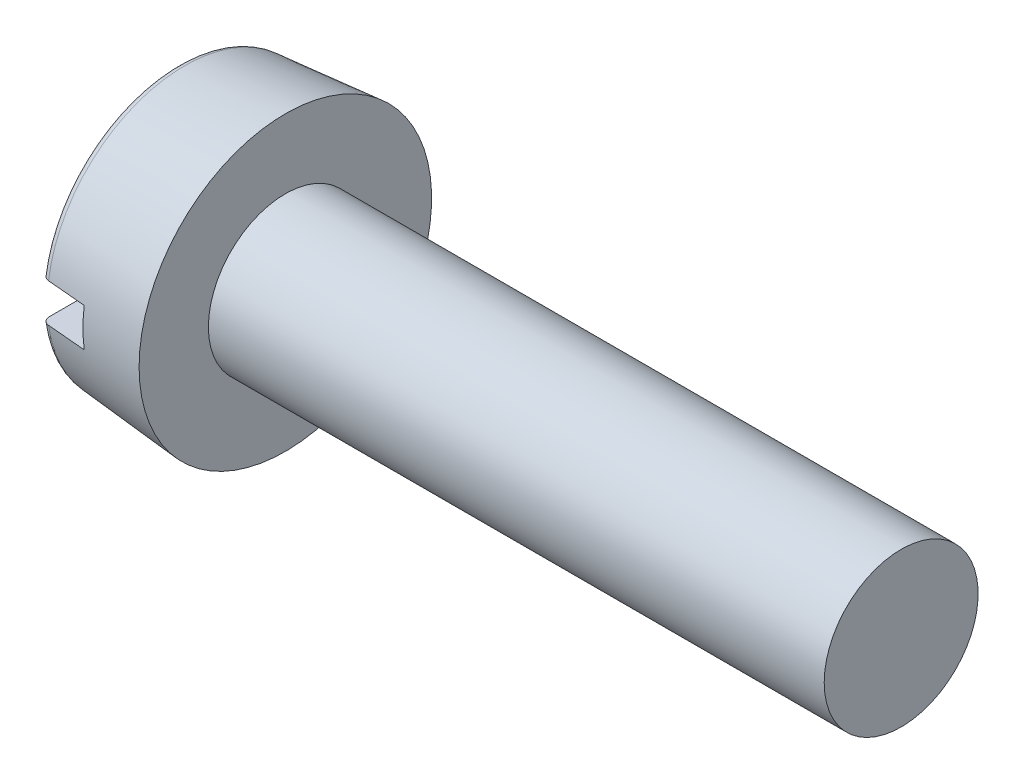
ISO-10303-21;
HEADER;
FILE_DESCRIPTION(('STEP AP214'),'2;1');
FILE_NAME('part.step','',(''),(''),'','','');
FILE_SCHEMA(('AUTOMOTIVE_DESIGN { 1 0 10303 214 1 1 1 1 }'));
ENDSEC;
DATA;
#1=APPLICATION_CONTEXT('core data for automotive mechanical design processes');
#2=APPLICATION_PROTOCOL_DEFINITION('international standard','automotive_design',2000,#1);
#3=PRODUCT_CONTEXT('',#1,'mechanical');
#4=PRODUCT('Part','Part','',(#3));
#5=PRODUCT_RELATED_PRODUCT_CATEGORY('part','',(#4));
#6=PRODUCT_DEFINITION_FORMATION('','',#4);
#7=PRODUCT_DEFINITION_CONTEXT('part definition',#1,'design');
#8=PRODUCT_DEFINITION('design','',#6,#7);
#9=PRODUCT_DEFINITION_SHAPE('','',#8);
#10=(LENGTH_UNIT() NAMED_UNIT(*) SI_UNIT(.MILLI.,.METRE.));
#11=(NAMED_UNIT(*) PLANE_ANGLE_UNIT() SI_UNIT($,.RADIAN.));
#12=(NAMED_UNIT(*) SI_UNIT($,.STERADIAN.) SOLID_ANGLE_UNIT());
#13=UNCERTAINTY_MEASURE_WITH_UNIT(LENGTH_MEASURE(1.E-05),#10,'distance_accuracy_value','');
#14=(GEOMETRIC_REPRESENTATION_CONTEXT(3) GLOBAL_UNCERTAINTY_ASSIGNED_CONTEXT((#13)) GLOBAL_UNIT_ASSIGNED_CONTEXT((#10,
#11,#12)) REPRESENTATION_CONTEXT('',''));
#15=CARTESIAN_POINT('',(0.,0.,0.));
#16=DIRECTION('',(0.,0.,1.));
#17=DIRECTION('',(1.,0.,0.));
#18=AXIS2_PLACEMENT_3D('',#15,#16,#17);
#19=CARTESIAN_POINT('',(0.,0.,0.));
#20=DIRECTION('',(-1.,0.,0.));
#21=DIRECTION('',(0.,0.,1.));
#22=AXIS2_PLACEMENT_3D('',#19,#20,#21);
#23=PLANE('',#22);
#24=DIRECTION('',(0.,0.,-1.));
#25=VECTOR('',#24,1.);
#26=CARTESIAN_POINT('',(0.,0.249999999999999,1.9));
#27=LINE('',#26,#25);
#28=CARTESIAN_POINT('',(0.,0.249999999999999,1.66724343126457));
#29=VERTEX_POINT('',#28);
#30=CARTESIAN_POINT('',(0.,0.249999999999999,-1.66724343126457));
#31=VERTEX_POINT('',#30);
#32=EDGE_CURVE('E99',#29,#31,#27,.T.);
#33=ORIENTED_EDGE('',*,*,#32,.F.);
#34=CARTESIAN_POINT('',(0.,0.,0.));
#35=DIRECTION('',(-1.,0.,0.));
#36=DIRECTION('',(0.,0.,1.));
#37=AXIS2_PLACEMENT_3D('',#34,#35,#36);
#38=CIRCLE('',#37,1.68588275366196);
#39=EDGE_CURVE('E102',#29,#31,#38,.T.);
#40=ORIENTED_EDGE('',*,*,#39,.T.);
#41=EDGE_LOOP('',(#33,#40));
#42=FACE_BOUND('',#41,.T.);
#43=ADVANCED_FACE('F32',(#42),#23,.T.);
#44=CARTESIAN_POINT('',(0.1,0.,0.));
#45=DIRECTION('',(-1.,0.,0.));
#46=DIRECTION('',(0.,0.,1.));
#47=AXIS2_PLACEMENT_3D('',#44,#45,#46);
#48=TOROIDAL_SURFACE('',#47,1.68588275366196,0.1);
#49=CARTESIAN_POINT('',(0.0480873293682884,0.249999999999999,-1.75362185744869));
#50=CARTESIAN_POINT('',(0.0528417345135133,0.249999999999999,-1.75653850601676));
#51=CARTESIAN_POINT('',(0.0578445385060203,0.249999999999999,-1.7590576122269));
#52=CARTESIAN_POINT('',(0.0682058046574192,0.249999999999999,-1.76322291744258));
#53=CARTESIAN_POINT('',(0.0735646527663155,0.249999999999999,-1.76486815121543));
#54=CARTESIAN_POINT('',(0.0844818886306088,0.249999999999999,-1.76723346694031));
#55=CARTESIAN_POINT('',(0.0900402234853762,0.249999999999999,-1.76795379232659));
#56=CARTESIAN_POINT('',(0.101197412742158,0.249999999999999,-1.76844791481951));
#57=CARTESIAN_POINT('',(0.106796257323168,0.249999999999999,-1.76822193414399));
#58=CARTESIAN_POINT('',(0.117861523485686,0.249999999999999,-1.76683270699279));
#59=CARTESIAN_POINT('',(0.123328252050226,0.249999999999999,-1.76567190376453));
#60=CARTESIAN_POINT('',(0.133989981500434,0.249999999999999,-1.76245071972289));
#61=CARTESIAN_POINT('',(0.139184972600806,0.249999999999999,-1.76039030653939));
#62=CARTESIAN_POINT('',(0.149167754519751,0.249999999999999,-1.75542584689958));
#63=CARTESIAN_POINT('',(0.153954705377947,0.249999999999999,-1.75252011208993));
#64=CARTESIAN_POINT('',(0.162977412055322,0.249999999999999,-1.74595172443565));
#65=CARTESIAN_POINT('',(0.167213151332164,0.249999999999999,-1.7422890488831));
#66=CARTESIAN_POINT('',(0.175047181623929,0.249999999999999,-1.73428290443729));
#67=CARTESIAN_POINT('',(0.178640577421525,0.249999999999999,-1.72993464647746));
#68=CARTESIAN_POINT('',(0.185054891388917,0.249999999999999,-1.72070159610584));
#69=CARTESIAN_POINT('',(0.18787577147407,0.249999999999999,-1.71581677725849));
#70=CARTESIAN_POINT('',(0.192694710215294,0.249999999999999,-1.70559727497278));
#71=CARTESIAN_POINT('',(0.194684300197193,0.249999999999999,-1.7002585980575));
#72=CARTESIAN_POINT('',(0.197747710121013,0.249999999999999,-1.68932466073286));
#73=CARTESIAN_POINT('',(0.198821481369151,0.249999999999999,-1.68372938669699));
#74=CARTESIAN_POINT('',(0.200031012294652,0.249999999999999,-1.67238876484539));
#75=CARTESIAN_POINT('',(0.200158491207255,0.249999999999999,-1.66664253276593));
#76=CARTESIAN_POINT('',(0.199450841542091,0.249999999999999,-1.65520954556987));
#77=CARTESIAN_POINT('',(0.198615682721226,0.249999999999999,-1.64952279232757));
#78=CARTESIAN_POINT('',(0.196000441538797,0.249999999999999,-1.63834849913795));
#79=CARTESIAN_POINT('',(0.194216879938357,0.249999999999999,-1.63286177270642));
#80=CARTESIAN_POINT('',(0.189750766345415,0.249999999999999,-1.62226709647776));
#81=CARTESIAN_POINT('',(0.187068220660723,0.249999999999999,-1.61715914402324));
#82=CARTESIAN_POINT('',(0.180888267263877,0.249999999999999,-1.60748805172865));
#83=CARTESIAN_POINT('',(0.177393801116361,0.249999999999999,-1.60292303303285));
#84=CARTESIAN_POINT('',(0.169681057616199,0.249999999999999,-1.59445179827417));
#85=CARTESIAN_POINT('',(0.165462816077553,0.249999999999999,-1.59054554963285));
#86=CARTESIAN_POINT('',(0.156466192887733,0.249999999999999,-1.58354500142123));
#87=CARTESIAN_POINT('',(0.151693762952304,0.249999999999999,-1.58044305451219));
#88=CARTESIAN_POINT('',(0.141690992230495,0.249999999999999,-1.57509561735458));
#89=CARTESIAN_POINT('',(0.136460683533162,0.249999999999999,-1.57285006714703));
#90=CARTESIAN_POINT('',(0.125757113585432,0.249999999999999,-1.56930636492891));
#91=CARTESIAN_POINT('',(0.120287455256155,0.249999999999999,-1.56799732722471));
#92=CARTESIAN_POINT('',(0.109205542328572,0.249999999999999,-1.56632423072197));
#93=CARTESIAN_POINT('',(0.103593295421033,0.249999999999999,-1.56596012106588));
#94=CARTESIAN_POINT('',(0.0924324256322543,0.249999999999999,-1.56618721235824));
#95=CARTESIAN_POINT('',(0.0868836490225736,0.249999999999999,-1.56677094123455));
#96=CARTESIAN_POINT('',(0.0759629957145553,0.249999999999999,-1.56886166208609));
#97=CARTESIAN_POINT('',(0.0705911172292269,0.249999999999999,-1.57036864473178));
#98=CARTESIAN_POINT('',(0.0601744666780116,0.249999999999999,-1.57426044910661));
#99=CARTESIAN_POINT('',(0.0551297558500487,0.249999999999999,-1.57664543462223));
#100=CARTESIAN_POINT('',(0.0455079973149395,0.249999999999999,-1.58222199942655));
#101=CARTESIAN_POINT('',(0.0409309652538046,0.249999999999999,-1.58541360568804));
#102=CARTESIAN_POINT('',(0.0323341233222692,0.249999999999999,-1.5925388942191));
#103=CARTESIAN_POINT('',(0.0283190828013294,0.249999999999999,-1.59647832925923));
#104=CARTESIAN_POINT('',(0.0209979682531496,0.249999999999999,-1.60496844514162));
#105=CARTESIAN_POINT('',(0.0176919383566988,0.249999999999999,-1.60951916400325));
#106=CARTESIAN_POINT('',(0.0118417029367167,0.249999999999999,-1.61915988938881));
#107=CARTESIAN_POINT('',(0.00930689495907744,0.249999999999999,-1.62425559893871));
#108=CARTESIAN_POINT('',(0.00511916459390329,0.249999999999999,-1.63479736889088));
#109=CARTESIAN_POINT('',(0.00346629492169,0.249999999999999,-1.64024345021381));
#110=CARTESIAN_POINT('',(0.00107425214991745,0.249999999999999,-1.65138896077525));
#111=CARTESIAN_POINT('',(0.000344232033673303,0.249999999999999,-1.65709035597217));
#112=CARTESIAN_POINT('',(-0.000152144921413755,0.249999999999999,-1.6685348302435));
#113=CARTESIAN_POINT('',(8.14904040030011E-05,0.249999999999999,-1.67427790897858));
#114=CARTESIAN_POINT('',(0.00150941394460469,0.249999999999999,-1.68566429737331));
#115=CARTESIAN_POINT('',(0.00270711559117895,0.249999999999999,-1.69130717958753));
#116=CARTESIAN_POINT('',(0.00603667272377987,0.249999999999999,-1.70231209106488));
#117=CARTESIAN_POINT('',(0.00816874993776049,0.249999999999999,-1.7076740533272));
#118=CARTESIAN_POINT('',(0.0133010207744541,0.249999999999999,-1.71794362558949));
#119=CARTESIAN_POINT('',(0.0162984796175963,0.249999999999999,-1.72285260360003));
#120=CARTESIAN_POINT('',(0.0230800245558298,0.249999999999999,-1.73208714088608));
#121=CARTESIAN_POINT('',(0.0268631253077146,0.249999999999999,-1.73641341987715));
#122=CARTESIAN_POINT('',(0.0335850501357742,0.249999999999999,-1.74289069653632));
#123=CARTESIAN_POINT('',(0.0363210854206854,0.249999999999999,-1.74525571168926));
#124=CARTESIAN_POINT('',(0.0420324526674357,0.249999999999999,-1.74967669866826));
#125=CARTESIAN_POINT('',(0.0450077834783863,0.249999999999999,-1.75173267198053));
#126=CARTESIAN_POINT('',(0.0480873293682884,0.249999999999999,-1.75362185744869));
#127=B_SPLINE_CURVE_WITH_KNOTS('',3,(#49,#50,#51,#52,#53,#54,#55,#56,#57,#58,#59,#60,#61,#62,
#63,#64,#65,#66,#67,#68,#69,#70,#71,#72,#73,#74,#75,#76,#77,#78,#79,#80,#81,#82,#83,#84,#85,#86,
#87,#88,#89,#90,#91,#92,#93,#94,#95,#96,#97,#98,#99,#100,#101,#102,#103,#104,#105,#106,#107,
#108,#109,#110,#111,#112,#113,#114,#115,#116,#117,#118,#119,#120,#121,#122,#123,#124,#125,#126),
.UNSPECIFIED.,.T.,.F.,(4,2,2,2,2,2,2,2,2,2,2,2,2,2,2,2,2,2,2,2,2,2,2,2,2,2,2,2,2,2,2,2,2,2,2,2,
2,2,4),(0.,0.016720140096957,0.0334587101610702,0.0501928737596846,0.066923107952031,
0.0836097574511354,0.100297007425309,0.117017818243882,0.133739130752831,0.150582894307229,
0.167427488101428,0.184439730194446,0.201452876766437,0.218614727500575,0.235777117421626,
0.253002906812364,0.2702285753392,0.28739278296071,0.304556141504208,0.321549772167314,
0.3385422128352,0.355333780468696,0.37212444433407,0.388783384217504,0.405442155763887,
0.422104036485943,0.43876647444236,0.455562704487484,0.47235997967336,0.489354416162254,
0.506349868330876,0.523512594705754,0.540675181526184,0.557898803947026,0.575126515760103,
0.592300369577475,0.609452812833943,0.620282913502755,0.631112962087463),.UNSPECIFIED.);
#128=CARTESIAN_POINT('',(0.0912844257245786,0.249999999999999,-1.76791351316472));
#129=VERTEX_POINT('',#128);
#130=EDGE_CURVE('E55',#31,#129,#127,.T.);
#131=ORIENTED_EDGE('',*,*,#130,.F.);
#132=ORIENTED_EDGE('',*,*,#39,.F.);
#133=CARTESIAN_POINT('',(0.0418342922826221,0.249999999999999,1.58494369094898));
#134=CARTESIAN_POINT('',(0.0463532811416453,0.249999999999999,1.58167266746194));
#135=CARTESIAN_POINT('',(0.0511494752376469,0.249999999999999,1.57877816482387));
#136=CARTESIAN_POINT('',(0.0611628842618519,0.249999999999999,1.57383163040233));
#137=CARTESIAN_POINT('',(0.0663805415867758,0.249999999999999,1.57178049799615));
#138=CARTESIAN_POINT('',(0.0770867246355591,0.249999999999999,1.56858603448799));
#139=CARTESIAN_POINT('',(0.0825752181716776,0.249999999999999,1.56744259578511));
#140=CARTESIAN_POINT('',(0.0936651455025564,0.249999999999999,1.56609899190505));
#141=CARTESIAN_POINT('',(0.0992665521461696,0.249999999999999,1.56589860261602));
#142=CARTESIAN_POINT('',(0.110395527902356,0.249999999999999,1.56644522501636));
#143=CARTESIAN_POINT('',(0.115923323599414,0.249999999999999,1.56718763526188));
#144=CARTESIAN_POINT('',(0.126776055384658,0.249999999999999,1.56958926373733));
#145=CARTESIAN_POINT('',(0.132100985684337,0.249999999999999,1.57124850810705));
#146=CARTESIAN_POINT('',(0.142403127504996,0.249999999999999,1.57543548182712));
#147=CARTESIAN_POINT('',(0.147380016853343,0.249999999999999,1.57796400336687));
#148=CARTESIAN_POINT('',(0.156843485682961,0.249999999999999,1.58381392511349));
#149=CARTESIAN_POINT('',(0.161330047624717,0.249999999999999,1.58713535366993));
#150=CARTESIAN_POINT('',(0.169727499356035,0.249999999999999,1.59450599534441));
#151=CARTESIAN_POINT('',(0.173633140447336,0.249999999999999,1.59856118690174));
#152=CARTESIAN_POINT('',(0.180717819926981,0.249999999999999,1.60726302421068));
#153=CARTESIAN_POINT('',(0.183896814860642,0.249999999999999,1.61190970530853));
#154=CARTESIAN_POINT('',(0.189477399818523,0.249999999999999,1.62172140451652));
#155=CARTESIAN_POINT('',(0.191869378797595,0.249999999999999,1.62689188961368));
#156=CARTESIAN_POINT('',(0.195760639923284,0.249999999999999,1.63755854551879));
#157=CARTESIAN_POINT('',(0.197259870802506,0.249999999999999,1.64305473501087));
#158=CARTESIAN_POINT('',(0.199335804664121,0.249999999999999,1.65427243917154));
#159=CARTESIAN_POINT('',(0.199903676169888,0.249999999999999,1.65999558974458));
#160=CARTESIAN_POINT('',(0.200073802172401,0.249999999999999,1.67145632900006));
#161=CARTESIAN_POINT('',(0.199676030862752,0.249999999999999,1.67719391806427));
#162=CARTESIAN_POINT('',(0.197921983082828,0.249999999999999,1.68853872843157));
#163=CARTESIAN_POINT('',(0.196562798101885,0.249999999999999,1.69414550068062));
#164=CARTESIAN_POINT('',(0.19291855459983,0.249999999999999,1.70504976845351));
#165=CARTESIAN_POINT('',(0.190633507910685,0.249999999999999,1.7103472679287));
#166=CARTESIAN_POINT('',(0.18521067670402,0.249999999999999,1.72045794038692));
#167=CARTESIAN_POINT('',(0.182076480100984,0.249999999999999,1.72527303698718));
#168=CARTESIAN_POINT('',(0.175037276678029,0.249999999999999,1.73430247114869));
#169=CARTESIAN_POINT('',(0.171132304750303,0.249999999999999,1.73851683588958));
#170=CARTESIAN_POINT('',(0.16269980941476,0.249999999999999,1.74618391309779));
#171=CARTESIAN_POINT('',(0.158178241140727,0.249999999999999,1.74964317455331));
#172=CARTESIAN_POINT('',(0.148613723265412,0.249999999999999,1.75574446359265));
#173=CARTESIAN_POINT('',(0.143570803145363,0.249999999999999,1.75838653735284));
#174=CARTESIAN_POINT('',(0.133160627334126,0.249999999999999,1.76275138353643));
#175=CARTESIAN_POINT('',(0.127797087069988,0.249999999999999,1.76448301903225));
#176=CARTESIAN_POINT('',(0.116854443309953,0.249999999999999,1.76701425809577));
#177=CARTESIAN_POINT('',(0.111275349460576,0.249999999999999,1.76781390332239));
#178=CARTESIAN_POINT('',(0.100100887151107,0.249999999999999,1.76845472762794));
#179=CARTESIAN_POINT('',(0.0945058921486114,0.249999999999999,1.76830243663541));
#180=CARTESIAN_POINT('',(0.0834212562472297,0.249999999999999,1.76705930737017));
#181=CARTESIAN_POINT('',(0.0779316136460949,0.249999999999999,1.76596848427502));
#182=CARTESIAN_POINT('',(0.0672202971549512,0.249999999999999,1.76288298465429));
#183=CARTESIAN_POINT('',(0.0619982892211327,0.249999999999999,1.76088946698432));
#184=CARTESIAN_POINT('',(0.0519608952149726,0.249999999999999,1.7560579885448));
#185=CARTESIAN_POINT('',(0.0471455152496653,0.249999999999999,1.75322001509549));
#186=CARTESIAN_POINT('',(0.0380328761201563,0.249999999999999,1.74676737199609));
#187=CARTESIAN_POINT('',(0.033738153429192,0.249999999999999,1.74314912131001));
#188=CARTESIAN_POINT('',(0.0258104443215391,0.249999999999999,1.73524874260489));
#189=CARTESIAN_POINT('',(0.0221774871632589,0.249999999999999,1.73096658524825));
#190=CARTESIAN_POINT('',(0.0156412544419074,0.249999999999999,1.72181931745527));
#191=CARTESIAN_POINT('',(0.0127448065966102,0.249999999999999,1.71694932874091));
#192=CARTESIAN_POINT('',(0.00780134883274687,0.249999999999999,1.70679582643646));
#193=CARTESIAN_POINT('',(0.00575438647200135,0.249999999999999,1.70151228971385));
#194=CARTESIAN_POINT('',(0.00254729503795473,0.249999999999999,1.69062549600824));
#195=CARTESIAN_POINT('',(0.00139616665763701,0.249999999999999,1.68501958690022));
#196=CARTESIAN_POINT('',(4.43746152318251E-05,0.249999999999999,1.67369448085401));
#197=CARTESIAN_POINT('',(-0.000156282209701495,0.249999999999999,1.66797528310118));
#198=CARTESIAN_POINT('',(0.000399288316155012,0.249999999999999,1.65654485378828));
#199=CARTESIAN_POINT('',(0.00116196206004032,0.249999999999999,1.65083393465618));
#200=CARTESIAN_POINT('',(0.00363496698668943,0.249999999999999,1.63961934314072));
#201=CARTESIAN_POINT('',(0.00534554513299491,0.249999999999999,1.63411572516609));
#202=CARTESIAN_POINT('',(0.00966997727855107,0.249999999999999,1.62346998148041));
#203=CARTESIAN_POINT('',(0.0122846703586636,0.249999999999999,1.61832819692945));
#204=CARTESIAN_POINT('',(0.0183443328587984,0.249999999999999,1.60856534573627));
#205=CARTESIAN_POINT('',(0.0217882842848239,0.249999999999999,1.60394365076356));
#206=CARTESIAN_POINT('',(0.0280254593310223,0.249999999999999,1.59691310866783));
#207=CARTESIAN_POINT('',(0.0306023952294619,0.249999999999999,1.59430918957683));
#208=CARTESIAN_POINT('',(0.0360245534387367,0.249999999999999,1.58939739902464));
#209=CARTESIAN_POINT('',(0.0388697747145162,0.249999999999999,1.58708952642137));
#210=CARTESIAN_POINT('',(0.0418342922826221,0.249999999999999,1.58494369094898));
#211=B_SPLINE_CURVE_WITH_KNOTS('',3,(#133,#134,#135,#136,#137,#138,#139,#140,#141,#142,#143,
#144,#145,#146,#147,#148,#149,#150,#151,#152,#153,#154,#155,#156,#157,#158,#159,#160,#161,#162,
#163,#164,#165,#166,#167,#168,#169,#170,#171,#172,#173,#174,#175,#176,#177,#178,#179,#180,#181,
#182,#183,#184,#185,#186,#187,#188,#189,#190,#191,#192,#193,#194,#195,#196,#197,#198,#199,#200,
#201,#202,#203,#204,#205,#206,#207,#208,#209,#210),.UNSPECIFIED.,.T.,.F.,(4,2,2,2,2,2,2,2,2,2,2,
2,2,2,2,2,2,2,2,2,2,2,2,2,2,2,2,2,2,2,2,2,2,2,2,2,2,2,4),(0.,0.0167226276620051,
0.03346304251352,0.0502014726065834,0.0669359246787318,0.08358901530841,0.100242580757686,
0.116911363337434,0.133580741981598,0.150392611170234,0.167205485474536,0.184216653548681,
0.201228798420416,0.218401344908859,0.235574350331357,0.25279953171257,0.270024492973039,
0.287177779010794,0.304330288715244,0.321327538121682,0.338323826898403,0.355151441904756,
0.371978304706744,0.388689868747911,0.405401162541563,0.422091063372285,0.438781214819503,
0.455549659879966,0.472318846137986,0.489238244449781,0.506158589853917,0.523246819247647,
0.540335171564237,0.55753848351341,0.574746279659214,0.591970088878111,0.609172861063463,
0.620143172407183,0.631113441428741),.UNSPECIFIED.);
#212=CARTESIAN_POINT('',(0.0912844257259858,0.249999999999999,1.76791351317408));
#213=VERTEX_POINT('',#212);
#214=EDGE_CURVE('E91',#213,#29,#211,.T.);
#215=ORIENTED_EDGE('',*,*,#214,.F.);
#216=CARTESIAN_POINT('',(0.0912844257252368,0.,0.));
#217=DIRECTION('',(-1.,0.,0.));
#218=DIRECTION('',(0.,0.,1.));
#219=AXIS2_PLACEMENT_3D('',#216,#217,#218);
#220=CIRCLE('',#219,1.78550222347114);
#221=EDGE_CURVE('E106',#129,#213,#220,.F.);
#222=ORIENTED_EDGE('',*,*,#221,.F.);
#223=EDGE_LOOP('',(#131,#132,#215,#222));
#224=FACE_BOUND('',#223,.T.);
#225=ADVANCED_FACE('F178',(#224),#48,.T.);
#226=CARTESIAN_POINT('',(-25.4,0.,0.));
#227=DIRECTION('',(-1.,0.,0.));
#228=DIRECTION('',(0.,0.,1.));
#229=AXIS2_PLACEMENT_3D('',#226,#227,#228);
#230=CYLINDRICAL_SURFACE('',#229,1.);
#231=CARTESIAN_POINT('',(9.4,0.,0.));
#232=DIRECTION('',(-1.,0.,0.));
#233=DIRECTION('',(0.,0.,1.));
#234=AXIS2_PLACEMENT_3D('',#231,#232,#233);
#235=CIRCLE('',#234,1.);
#236=CARTESIAN_POINT('',(9.4,0.,1.));
#237=VERTEX_POINT('',#236);
#238=EDGE_CURVE('E103',#237,#237,#235,.T.);
#239=ORIENTED_EDGE('',*,*,#238,.T.);
#240=EDGE_LOOP('',(#239));
#241=FACE_BOUND('',#240,.T.);
#242=CARTESIAN_POINT('',(1.4,0.,0.));
#243=DIRECTION('',(-1.,0.,0.));
#244=DIRECTION('',(0.,0.,1.));
#245=AXIS2_PLACEMENT_3D('',#242,#243,#244);
#246=CIRCLE('',#245,1.);
#247=CARTESIAN_POINT('',(1.4,0.,1.));
#248=VERTEX_POINT('',#247);
#249=EDGE_CURVE('E166',#248,#248,#246,.T.);
#250=ORIENTED_EDGE('',*,*,#249,.F.);
#251=EDGE_LOOP('',(#250));
#252=FACE_BOUND('',#251,.T.);
#253=ADVANCED_FACE('F34',(#241,#252),#230,.T.);
#254=CARTESIAN_POINT('',(9.4,1.,0.));
#255=DIRECTION('',(1.,0.,0.));
#256=DIRECTION('',(0.,0.,-1.));
#257=AXIS2_PLACEMENT_3D('',#254,#255,#256);
#258=PLANE('',#257);
#259=ORIENTED_EDGE('',*,*,#238,.F.);
#260=EDGE_LOOP('',(#259));
#261=FACE_BOUND('',#260,.T.);
#262=ADVANCED_FACE('F177',(#261),#258,.T.);
#263=DIRECTION('',(0.,0.,1.));
#264=VECTOR('',#263,1.);
#265=CARTESIAN_POINT('',(0.,-0.25,-1.9));
#266=LINE('',#265,#264);
#267=CARTESIAN_POINT('',(0.,-0.25,-1.66724343126457));
#268=VERTEX_POINT('',#267);
#269=CARTESIAN_POINT('',(0.,-0.25,1.66724343126457));
#270=VERTEX_POINT('',#269);
#271=EDGE_CURVE('E47',#268,#270,#266,.T.);
#272=ORIENTED_EDGE('',*,*,#271,.F.);
#273=EDGE_CURVE('E97',#268,#270,#38,.T.);
#274=ORIENTED_EDGE('',*,*,#273,.T.);
#275=EDGE_LOOP('',(#272,#274));
#276=FACE_BOUND('',#275,.T.);
#277=ADVANCED_FACE('F96',(#276),#23,.T.);
#278=CARTESIAN_POINT('',(0.,0.,0.));
#279=DIRECTION('',(1.,0.,0.));
#280=DIRECTION('',(0.,0.,-1.));
#281=AXIS2_PLACEMENT_3D('',#278,#279,#280);
#282=CONICAL_SURFACE('',#281,1.77751587106371,0.0872664625997168);
#283=CARTESIAN_POINT('',(3.62107818810661,0.249999999999999,2.07934430853245));
#284=CARTESIAN_POINT('',(3.06980125604965,0.249999999999999,2.03076587392467));
#285=CARTESIAN_POINT('',(2.51852633750628,0.249999999999999,1.98216457470873));
#286=CARTESIAN_POINT('',(1.41598182372261,0.249999999999999,1.88490176224617));
#287=CARTESIAN_POINT('',(0.864712228482192,0.249999999999999,1.83624024900076));
#288=CARTESIAN_POINT('',(-0.237820369493234,0.249999999999999,1.7388425212793));
#289=CARTESIAN_POINT('',(-0.789083372228186,0.249999999999999,1.69010630680258));
#290=CARTESIAN_POINT('',(-1.89160065704932,0.249999999999999,1.59253521876818));
#291=CARTESIAN_POINT('',(-2.44285493913533,0.249999999999999,1.5437003452085));
#292=CARTESIAN_POINT('',(-2.99410378813087,0.249999999999999,1.49480416395094));
#293=B_SPLINE_CURVE_WITH_KNOTS('',3,(#283,#284,#285,#286,#287,#288,#289,#290,#291,#292),
.UNSPECIFIED.,.F.,.F.,(4,2,2,2,4),(0.,1.66023946632278,3.32047889930815,4.98071834715392,
6.64095782861457),.UNSPECIFIED.);
#294=CARTESIAN_POINT('',(0.6,0.249999999999999,1.8128522259904));
#295=VERTEX_POINT('',#294);
#296=EDGE_CURVE('E157',#295,#213,#293,.T.);
#297=ORIENTED_EDGE('',*,*,#296,.F.);
#298=CARTESIAN_POINT('',(0.6,0.,0.));
#299=DIRECTION('',(1.,0.,0.));
#300=DIRECTION('',(0.,0.,-1.));
#301=AXIS2_PLACEMENT_3D('',#298,#299,#300);
#302=CIRCLE('',#301,1.83000906917926);
#303=CARTESIAN_POINT('',(0.6,-0.25,1.8128522259904));
#304=VERTEX_POINT('',#303);
#305=EDGE_CURVE('E11',#304,#295,#302,.F.);
#306=ORIENTED_EDGE('',*,*,#305,.F.);
#307=CARTESIAN_POINT('',(-2.99410378813087,-0.25,1.49480416395094));
#308=CARTESIAN_POINT('',(-2.06836137178343,-0.25,1.57691372931172));
#309=CARTESIAN_POINT('',(-1.14260434025588,-0.25,1.65885820727604));
#310=CARTESIAN_POINT('',(-0.0400762748424796,-0.25,1.75630736694366));
#311=CARTESIAN_POINT('',(0.136684651711362,-0.25,1.77192637736924));
#312=CARTESIAN_POINT('',(1.41597857948217,-0.25,1.88493859856276));
#313=CARTESIAN_POINT('',(2.51852498766333,-0.25,1.98218009580805));
#314=CARTESIAN_POINT('',(3.62107818810661,-0.25,2.07934430853245));
#315=B_SPLINE_CURVE_WITH_KNOTS('',3,(#307,#308,#309,#310,#311,#312,#313,#314),.UNSPECIFIED.,.F.,
.F.,(4,2,2,4),(0.,2.78812996950874,3.32047892237668,6.64095781673274),.UNSPECIFIED.);
#316=CARTESIAN_POINT('',(0.0912844257252366,-0.25,1.76791351316188));
#317=VERTEX_POINT('',#316);
#318=EDGE_CURVE('E135',#317,#304,#315,.T.);
#319=ORIENTED_EDGE('',*,*,#318,.F.);
#320=CARTESIAN_POINT('',(0.0912844257252368,-0.25,-1.76791351316191));
#321=VERTEX_POINT('',#320);
#322=EDGE_CURVE('E112',#317,#321,#220,.F.);
#323=ORIENTED_EDGE('',*,*,#322,.T.);
#324=CARTESIAN_POINT('',(3.62107818810661,-0.25,-2.07934430853245));
#325=CARTESIAN_POINT('',(3.06980125604965,-0.25,-2.03076587392467));
#326=CARTESIAN_POINT('',(2.51852633750628,-0.25,-1.98216457470873));
#327=CARTESIAN_POINT('',(1.41598182372261,-0.25,-1.88490176224617));
#328=CARTESIAN_POINT('',(0.864712228482192,-0.25,-1.83624024900076));
#329=CARTESIAN_POINT('',(-0.237820369493234,-0.25,-1.7388425212793));
#330=CARTESIAN_POINT('',(-0.789083372228186,-0.25,-1.69010630680258));
#331=CARTESIAN_POINT('',(-1.89160065704932,-0.25,-1.59253521876818));
#332=CARTESIAN_POINT('',(-2.44285493913533,-0.25,-1.5437003452085));
#333=CARTESIAN_POINT('',(-2.99410378813087,-0.25,-1.49480416395094));
#334=B_SPLINE_CURVE_WITH_KNOTS('',3,(#324,#325,#326,#327,#328,#329,#330,#331,#332,#333),
.UNSPECIFIED.,.F.,.F.,(4,2,2,2,4),(0.,1.66023946632278,3.32047889930815,4.98071834715392,
6.64095782861457),.UNSPECIFIED.);
#335=CARTESIAN_POINT('',(0.6,-0.25,-1.8128522259904));
#336=VERTEX_POINT('',#335);
#337=EDGE_CURVE('E86',#336,#321,#334,.T.);
#338=ORIENTED_EDGE('',*,*,#337,.F.);
#339=CARTESIAN_POINT('',(0.6,0.249999999999999,-1.8128522259904));
#340=VERTEX_POINT('',#339);
#341=EDGE_CURVE('E36',#340,#336,#302,.F.);
#342=ORIENTED_EDGE('',*,*,#341,.F.);
#343=CARTESIAN_POINT('',(-2.99410378813087,0.249999999999999,-1.49480416395094));
#344=CARTESIAN_POINT('',(-2.06836137178342,0.249999999999999,-1.57691372931172));
#345=CARTESIAN_POINT('',(-1.14260434025588,0.249999999999999,-1.65885820727604));
#346=CARTESIAN_POINT('',(-0.0400762748424797,0.249999999999999,-1.75630736694366));
#347=CARTESIAN_POINT('',(0.136684651711362,0.249999999999999,-1.77192637736924));
#348=CARTESIAN_POINT('',(1.41597857948217,0.249999999999999,-1.88493859856276));
#349=CARTESIAN_POINT('',(2.51852498766334,0.249999999999999,-1.98218009580805));
#350=CARTESIAN_POINT('',(3.62107818810661,0.249999999999999,-2.07934430853245));
#351=B_SPLINE_CURVE_WITH_KNOTS('',3,(#343,#344,#345,#346,#347,#348,#349,#350),.UNSPECIFIED.,.F.,
.F.,(4,2,2,4),(0.,2.78812996950874,3.32047892237668,6.64095781673274),.UNSPECIFIED.);
#352=EDGE_CURVE('E161',#129,#340,#351,.T.);
#353=ORIENTED_EDGE('',*,*,#352,.F.);
#354=ORIENTED_EDGE('',*,*,#221,.T.);
#355=EDGE_LOOP('',(#297,#306,#319,#323,#338,#342,#353,#354));
#356=FACE_BOUND('',#355,.T.);
#357=CARTESIAN_POINT('',(1.4,0.,0.));
#358=DIRECTION('',(-1.,0.,0.));
#359=DIRECTION('',(0.,0.,1.));
#360=AXIS2_PLACEMENT_3D('',#357,#358,#359);
#361=CIRCLE('',#360,1.9);
#362=CARTESIAN_POINT('',(1.4,0.,1.9));
#363=VERTEX_POINT('',#362);
#364=EDGE_CURVE('E108',#363,#363,#361,.T.);
#365=ORIENTED_EDGE('',*,*,#364,.T.);
#366=EDGE_LOOP('',(#365));
#367=FACE_BOUND('',#366,.T.);
#368=ADVANCED_FACE('F147',(#356,#367),#282,.T.);
#369=CARTESIAN_POINT('',(1.4,1.,0.));
#370=DIRECTION('',(-1.,0.,0.));
#371=DIRECTION('',(0.,0.,1.));
#372=AXIS2_PLACEMENT_3D('',#369,#370,#371);
#373=PLANE('',#372);
#374=ORIENTED_EDGE('',*,*,#364,.F.);
#375=EDGE_LOOP('',(#374));
#376=FACE_BOUND('',#375,.T.);
#377=ORIENTED_EDGE('',*,*,#249,.T.);
#378=EDGE_LOOP('',(#377));
#379=FACE_BOUND('',#378,.T.);
#380=ADVANCED_FACE('F151',(#376,#379),#373,.F.);
#381=CARTESIAN_POINT('',(0.0480873293682884,-0.25,-1.75362185744869));
#382=CARTESIAN_POINT('',(0.0432739959337621,-0.25,-1.75066846112986));
#383=CARTESIAN_POINT('',(0.0387082622450219,-0.25,-1.7473032001112));
#384=CARTESIAN_POINT('',(0.0302046798517113,-0.25,-1.73984907438952));
#385=CARTESIAN_POINT('',(0.0262676628768836,-0.25,-1.73575926601579));
#386=CARTESIAN_POINT('',(0.0191376281718079,-0.25,-1.72698154486782));
#387=CARTESIAN_POINT('',(0.0159439377554331,-0.25,-1.72229417885716));
#388=CARTESIAN_POINT('',(0.0103830553836088,-0.25,-1.71245445973367));
#389=CARTESIAN_POINT('',(0.00801566110287527,-0.25,-1.70730222083813));
#390=CARTESIAN_POINT('',(0.00415366778007299,-0.25,-1.69663673838293));
#391=CARTESIAN_POINT('',(0.00266573056579946,-0.25,-1.6911210825085));
#392=CARTESIAN_POINT('',(0.000629031488439654,-0.25,-1.67991874091407));
#393=CARTESIAN_POINT('',(8.03534612329999E-05,-0.25,-1.67423203997312));
#394=CARTESIAN_POINT('',(-6.44845975120015E-05,-0.25,-1.66280271896129));
#395=CARTESIAN_POINT('',(0.00034669864101346,-0.25,-1.657060004702));
#396=CARTESIAN_POINT('',(0.00212540520056796,-0.25,-1.6457245163343));
#397=CARTESIAN_POINT('',(0.00349294840099519,-0.25,-1.64013174534522));
#398=CARTESIAN_POINT('',(0.00715090882437661,-0.25,-1.62924530270343));
#399=CARTESIAN_POINT('',(0.00944296438970648,-0.25,-1.62395218115361));
#400=CARTESIAN_POINT('',(0.0148879596768896,-0.25,-1.61382879086188));
#401=CARTESIAN_POINT('',(0.0180408807195176,-0.25,-1.60899851208019));
#402=CARTESIAN_POINT('',(0.025101149427418,-0.25,-1.59996832657873));
#403=CARTESIAN_POINT('',(0.0290041849071195,-0.25,-1.59576504963079));
#404=CARTESIAN_POINT('',(0.0374675070997774,-0.25,-1.5880823297297));
#405=CARTESIAN_POINT('',(0.0420277561783687,-0.25,-1.5846028453575));
#406=CARTESIAN_POINT('',(0.0516227103191307,-0.25,-1.57850784320304));
#407=CARTESIAN_POINT('',(0.0566516502047795,-0.25,-1.57588325051884));
#408=CARTESIAN_POINT('',(0.0670823683405315,-0.25,-1.57152671576251));
#409=CARTESIAN_POINT('',(0.0724841205749807,-0.25,-1.5697947114749));
#410=CARTESIAN_POINT('',(0.0834415384747239,-0.25,-1.56729158897232));
#411=CARTESIAN_POINT('',(0.0889947777169294,-0.25,-1.56650984241709));
#412=CARTESIAN_POINT('',(0.100153404652038,-0.25,-1.56589585659731));
#413=CARTESIAN_POINT('',(0.105758790081279,-0.25,-1.56606357630674));
#414=CARTESIAN_POINT('',(0.116828001733994,-0.25,-1.56733946295444));
#415=CARTESIAN_POINT('',(0.122292464533572,-0.25,-1.56844211899985));
#416=CARTESIAN_POINT('',(0.132959421595291,-0.25,-1.57154691372681));
#417=CARTESIAN_POINT('',(0.138161915096702,-0.25,-1.5735490550202));
#418=CARTESIAN_POINT('',(0.148173011159885,-0.25,-1.57839895936826));
#419=CARTESIAN_POINT('',(0.152980557534039,-0.25,-1.58124890135813));
#420=CARTESIAN_POINT('',(0.162054920176908,-0.25,-1.58770819503941));
#421=CARTESIAN_POINT('',(0.16632171247363,-0.25,-1.5913175803786));
#422=CARTESIAN_POINT('',(0.174237985573029,-0.25,-1.59922952205714));
#423=CARTESIAN_POINT('',(0.177881146300336,-0.25,-1.60353840078372));
#424=CARTESIAN_POINT('',(0.184402442740822,-0.25,-1.61270059483249));
#425=CARTESIAN_POINT('',(0.187280530600701,-0.25,-1.61755394418291));
#426=CARTESIAN_POINT('',(0.192225136492772,-0.25,-1.62772863858739));
#427=CARTESIAN_POINT('',(0.194281712719758,-0.25,-1.6330548159482));
#428=CARTESIAN_POINT('',(0.197479976826263,-0.25,-1.64397515725888));
#429=CARTESIAN_POINT('',(0.198621616384584,-0.25,-1.64956933534633));
#430=CARTESIAN_POINT('',(0.199965265154928,-0.25,-1.66091734164475));
#431=CARTESIAN_POINT('',(0.200159286283281,-0.25,-1.66667211719255));
#432=CARTESIAN_POINT('',(0.199580217673731,-0.25,-1.67813291635594));
#433=CARTESIAN_POINT('',(0.198807110068163,-0.25,-1.68383893906886));
#434=CARTESIAN_POINT('',(0.196311617733831,-0.25,-1.69504924743677));
#435=CARTESIAN_POINT('',(0.194587721979075,-0.25,-1.70055319706138));
#436=CARTESIAN_POINT('',(0.190235470444691,-0.25,-1.71119123052425));
#437=CARTESIAN_POINT('',(0.187607131282439,-0.25,-1.71632532115584));
#438=CARTESIAN_POINT('',(0.181534101865567,-0.25,-1.72604732090081));
#439=CARTESIAN_POINT('',(0.17809387267551,-0.25,-1.73063801581003));
#440=CARTESIAN_POINT('',(0.170484681986681,-0.25,-1.73916962328591));
#441=CARTESIAN_POINT('',(0.166315755075048,-0.25,-1.74311056667535));
#442=CARTESIAN_POINT('',(0.157409889221829,-0.25,-1.75019035917626));
#443=CARTESIAN_POINT('',(0.152678747710152,-0.25,-1.75333650066884));
#444=CARTESIAN_POINT('',(0.142751563033728,-0.25,-1.75878067569256));
#445=CARTESIAN_POINT('',(0.137555564478044,-0.25,-1.76107879049464));
#446=CARTESIAN_POINT('',(0.126900378044482,-0.25,-1.7647393296115));
#447=CARTESIAN_POINT('',(0.121444236415241,-0.25,-1.76611062471473));
#448=CARTESIAN_POINT('',(0.11037721138633,-0.25,-1.76791193877223));
#449=CARTESIAN_POINT('',(0.104766295152251,-0.25,-1.76834175641883));
#450=CARTESIAN_POINT('',(0.0935836438167777,-0.25,-1.76824702763991));
#451=CARTESIAN_POINT('',(0.0880118612008905,-0.25,-1.76772764206273));
#452=CARTESIAN_POINT('',(0.0770396713302445,-0.25,-1.76576022652535));
#453=CARTESIAN_POINT('',(0.071639060635824,-0.25,-1.76431334594022));
#454=CARTESIAN_POINT('',(0.0632085836628995,-0.25,-1.76127633962858));
#455=CARTESIAN_POINT('',(0.0600762840839112,-0.25,-1.75996264974523));
#456=CARTESIAN_POINT('',(0.0539619597919573,-0.25,-1.75702283959767));
#457=CARTESIAN_POINT('',(0.050979934384157,-0.25,-1.75539672077822));
#458=CARTESIAN_POINT('',(0.0480873293682884,-0.25,-1.75362185744869));
#459=B_SPLINE_CURVE_WITH_KNOTS('',3,(#381,#382,#383,#384,#385,#386,#387,#388,#389,#390,#391,
#392,#393,#394,#395,#396,#397,#398,#399,#400,#401,#402,#403,#404,#405,#406,#407,#408,#409,#410,
#411,#412,#413,#414,#415,#416,#417,#418,#419,#420,#421,#422,#423,#424,#425,#426,#427,#428,#429,
#430,#431,#432,#433,#434,#435,#436,#437,#438,#439,#440,#441,#442,#443,#444,#445,#446,#447,#448,
#449,#450,#451,#452,#453,#454,#455,#456,#457,#458),.UNSPECIFIED.,.T.,.F.,(4,2,2,2,2,2,2,2,2,2,2,
2,2,2,2,2,2,2,2,2,2,2,2,2,2,2,2,2,2,2,2,2,2,2,2,2,2,2,4),(0.,0.0169290199238089,
0.0338802529823928,0.0508160855623732,0.0677477683529474,0.084806116214961,0.101865986582227,
0.119056798098293,0.136247966962176,0.153469735348946,0.170691130084153,0.187816335341978,
0.204940560339604,0.221876586590736,0.238811432201848,0.255555070456248,0.272297985231116,
0.288942891119742,0.305587845340518,0.322275953942695,0.338964802081402,0.355813878853678,
0.372664009243622,0.389712291636001,0.406761474352061,0.423954130426253,0.441147104138771,
0.45836748059315,0.475587540673756,0.492715099140825,0.509841844880679,0.526805223301204,
0.543766975608042,0.560563992951393,0.577364601499572,0.594074136215666,0.610763003982537,
0.620936659112597,0.631110267197608),.UNSPECIFIED.);
#460=EDGE_CURVE('E82',#321,#268,#459,.T.);
#461=ORIENTED_EDGE('',*,*,#460,.F.);
#462=ORIENTED_EDGE('',*,*,#322,.F.);
#463=CARTESIAN_POINT('',(0.041834292282622,-0.25,1.58494369094898));
#464=CARTESIAN_POINT('',(0.037240225990333,-0.25,1.58826968293827));
#465=CARTESIAN_POINT('',(0.0329259974456987,-0.25,1.59198977792917));
#466=CARTESIAN_POINT('',(0.0249817435400249,-0.25,1.60010654578481));
#467=CARTESIAN_POINT('',(0.0213526496746514,-0.25,1.60450412521024));
#468=CARTESIAN_POINT('',(0.0148850167956602,-0.25,1.61384067170352));
#469=CARTESIAN_POINT('',(0.0120457247379181,-0.25,1.61877911677142));
#470=CARTESIAN_POINT('',(0.00722999398326375,-0.25,1.62905820426729));
#471=CARTESIAN_POINT('',(0.00525333716106039,-0.25,1.63439874462082));
#472=CARTESIAN_POINT('',(0.00220171757094199,-0.25,1.6453766662545));
#473=CARTESIAN_POINT('',(0.00113393237924121,-0.25,1.65101604349053));
#474=CARTESIAN_POINT('',(-4.49880994461484E-05,-0.25,1.66239426581817));
#475=CARTESIAN_POINT('',(-0.000156047344002616,-0.25,1.66813311877998));
#476=CARTESIAN_POINT('',(0.000584069693284209,-0.25,1.6795770844576));
#477=CARTESIAN_POINT('',(0.00143999783346555,-0.25,1.68528189085107));
#478=CARTESIAN_POINT('',(0.00409967677789387,-0.25,1.69646624261576));
#479=CARTESIAN_POINT('',(0.0059034235395822,-0.25,1.70194578894765));
#480=CARTESIAN_POINT('',(0.0104052147732591,-0.25,1.71250909370826));
#481=CARTESIAN_POINT('',(0.0131011224818146,-0.25,1.71759376230311));
#482=CARTESIAN_POINT('',(0.0193149750093382,-0.25,1.72723334196473));
#483=CARTESIAN_POINT('',(0.0228328865299314,-0.25,1.73178827447928));
#484=CARTESIAN_POINT('',(0.0305611138059803,-0.25,1.74019881591955));
#485=CARTESIAN_POINT('',(0.0347655784507264,-0.25,1.74405980038693));
#486=CARTESIAN_POINT('',(0.0437687509187802,-0.25,1.75101239014968));
#487=CARTESIAN_POINT('',(0.0485674262011699,-0.25,1.75410403754859));
#488=CARTESIAN_POINT('',(0.0585706284068226,-0.25,1.7593973340357));
#489=CARTESIAN_POINT('',(0.0637705616546314,-0.25,1.76160766505684));
#490=CARTESIAN_POINT('',(0.0744695858609113,-0.25,1.76511596424453));
#491=CARTESIAN_POINT('',(0.0799686618012449,-0.25,1.76641397816752));
#492=CARTESIAN_POINT('',(0.0910627415644579,-0.25,1.76805162789164));
#493=CARTESIAN_POINT('',(0.096656629785485,-0.25,1.76839882845312));
#494=CARTESIAN_POINT('',(0.10782289278291,-0.25,1.76814615775232));
#495=CARTESIAN_POINT('',(0.11339526808782,-0.25,1.76754630990668));
#496=CARTESIAN_POINT('',(0.124343727986196,-0.25,1.76542073067109));
#497=CARTESIAN_POINT('',(0.129720331100375,-0.25,1.76389766753555));
#498=CARTESIAN_POINT('',(0.140142716246296,-0.25,1.75997330104124));
#499=CARTESIAN_POINT('',(0.145188495759467,-0.25,1.75757199099727));
#500=CARTESIAN_POINT('',(0.154824324005497,-0.25,1.75195276262216));
#501=CARTESIAN_POINT('',(0.159412860990714,-0.25,1.74873225287671));
#502=CARTESIAN_POINT('',(0.167989635803426,-0.25,1.74157233510749));
#503=CARTESIAN_POINT('',(0.17197785162028,-0.25,1.73763290073622));
#504=CARTESIAN_POINT('',(0.179275987854369,-0.25,1.72911345040378));
#505=CARTESIAN_POINT('',(0.182580148847091,-0.25,1.72452850143051));
#506=CARTESIAN_POINT('',(0.188380798700313,-0.25,1.71487344660445));
#507=CARTESIAN_POINT('',(0.190877244997954,-0.25,1.70980331520303));
#508=CARTESIAN_POINT('',(0.19501780550923,-0.25,1.69926731901174));
#509=CARTESIAN_POINT('',(0.196653113194538,-0.25,1.69379799296059));
#510=CARTESIAN_POINT('',(0.198990466838801,-0.25,1.6826634062341));
#511=CARTESIAN_POINT('',(0.199692465834748,-0.25,1.67699813571377));
#512=CARTESIAN_POINT('',(0.200147236456463,-0.25,1.66558397528023));
#513=CARTESIAN_POINT('',(0.199892350656753,-0.25,1.65983477912793));
#514=CARTESIAN_POINT('',(0.198423516296998,-0.25,1.64846011399518));
#515=CARTESIAN_POINT('',(0.197209544557395,-0.25,1.64283464800846));
#516=CARTESIAN_POINT('',(0.193851194801899,-0.25,1.63185396900407));
#517=CARTESIAN_POINT('',(0.191704638231905,-0.25,1.62649942176363));
#518=CARTESIAN_POINT('',(0.186538689068665,-0.25,1.61622915648185));
#519=CARTESIAN_POINT('',(0.183519308749233,-0.25,1.61131343227096));
#520=CARTESIAN_POINT('',(0.176707624364611,-0.25,1.60208829994492));
#521=CARTESIAN_POINT('',(0.172919272324716,-0.25,1.59777597487306));
#522=CARTESIAN_POINT('',(0.16466531648065,-0.25,1.58985701816894));
#523=CARTESIAN_POINT('',(0.160199749316542,-0.25,1.58625034838204));
#524=CARTESIAN_POINT('',(0.150768823215848,-0.25,1.57988695897823));
#525=CARTESIAN_POINT('',(0.145809318506276,-0.25,1.57712156406315));
#526=CARTESIAN_POINT('',(0.135492650745262,-0.25,1.57247397484272));
#527=CARTESIAN_POINT('',(0.130135531508933,-0.25,1.57059168339068));
#528=CARTESIAN_POINT('',(0.119242383685116,-0.25,1.56778516588624));
#529=CARTESIAN_POINT('',(0.113709151273117,-0.25,1.56685007963762));
#530=CARTESIAN_POINT('',(0.10256278044582,-0.25,1.56592869935453));
#531=CARTESIAN_POINT('',(0.0969496256618977,-0.25,1.56594260255722));
#532=CARTESIAN_POINT('',(0.0858404986988545,-0.25,1.56691595810304));
#533=CARTESIAN_POINT('',(0.0803440266140538,-0.25,1.56786975778735));
#534=CARTESIAN_POINT('',(0.0695937211926705,-0.25,1.57068495787815));
#535=CARTESIAN_POINT('',(0.0643395985323676,-0.25,1.57254524369481));
#536=CARTESIAN_POINT('',(0.0562112798874521,-0.25,1.57621395893978));
#537=CARTESIAN_POINT('',(0.0532135332132112,-0.25,1.5777552339014));
#538=CARTESIAN_POINT('',(0.0473890635284811,-0.25,1.58113258100573));
#539=CARTESIAN_POINT('',(0.0445623394516816,-0.25,1.58296865131016));
#540=CARTESIAN_POINT('',(0.041834292282622,-0.25,1.58494369094898));
#541=B_SPLINE_CURVE_WITH_KNOTS('',3,(#463,#464,#465,#466,#467,#468,#469,#470,#471,#472,#473,
#474,#475,#476,#477,#478,#479,#480,#481,#482,#483,#484,#485,#486,#487,#488,#489,#490,#491,#492,
#493,#494,#495,#496,#497,#498,#499,#500,#501,#502,#503,#504,#505,#506,#507,#508,#509,#510,#511,
#512,#513,#514,#515,#516,#517,#518,#519,#520,#521,#522,#523,#524,#525,#526,#527,#528,#529,#530,
#531,#532,#533,#534,#535,#536,#537,#538,#539,#540),.UNSPECIFIED.,.T.,.F.,(4,2,2,2,2,2,2,2,2,2,2,
2,2,2,2,2,2,2,2,2,2,2,2,2,2,2,2,2,2,2,2,2,2,2,2,2,2,2,4),(0.,0.01700249213063,
0.0340279366161811,0.0510370919482804,0.0680419438627628,0.0851798731168446,0.102319164514149,
0.119543047588474,0.136766857201494,0.153949710054629,0.171131866971922,0.188174577285752,
0.205216354697442,0.222085838631795,0.23895447643204,0.255688510400726,0.272422130611692,
0.289107616796491,0.305793229993744,0.322532296654329,0.339271976899638,0.356147328880665,
0.37302356997053,0.390069201179459,0.407115690072263,0.424298882383909,0.441482489998281,
0.458706456856354,0.475930181519504,0.493067531892181,0.510203955395806,0.527157157560035,
0.544108494332694,0.560863197105543,0.577621382172203,0.594279392670392,0.610916972434852,
0.621013450544212,0.631109865696465),.UNSPECIFIED.);
#542=EDGE_CURVE('E92',#270,#317,#541,.T.);
#543=ORIENTED_EDGE('',*,*,#542,.F.);
#544=ORIENTED_EDGE('',*,*,#273,.F.);
#545=EDGE_LOOP('',(#461,#462,#543,#544));
#546=FACE_BOUND('',#545,.T.);
#547=ADVANCED_FACE('F101',(#546),#48,.T.);
#548=CARTESIAN_POINT('',(0.6,0.249999999999999,1.9));
#549=DIRECTION('',(0.,1.,0.));
#550=DIRECTION('',(0.,0.,1.));
#551=AXIS2_PLACEMENT_3D('',#548,#549,#550);
#552=PLANE('',#551);
#553=ORIENTED_EDGE('',*,*,#352,.T.);
#554=DIRECTION('',(0.,0.,-1.));
#555=VECTOR('',#554,1.);
#556=CARTESIAN_POINT('',(0.6,0.249999999999999,1.9));
#557=LINE('',#556,#555);
#558=EDGE_CURVE('E98',#295,#340,#557,.T.);
#559=ORIENTED_EDGE('',*,*,#558,.F.);
#560=ORIENTED_EDGE('',*,*,#296,.T.);
#561=ORIENTED_EDGE('',*,*,#214,.T.);
#562=ORIENTED_EDGE('',*,*,#32,.T.);
#563=ORIENTED_EDGE('',*,*,#130,.T.);
#564=EDGE_LOOP('',(#553,#559,#560,#561,#562,#563));
#565=FACE_BOUND('',#564,.T.);
#566=ADVANCED_FACE('F128',(#565),#552,.F.);
#567=CARTESIAN_POINT('',(0.6,-0.25,-1.9));
#568=DIRECTION('',(0.,-1.,0.));
#569=DIRECTION('',(0.,0.,-1.));
#570=AXIS2_PLACEMENT_3D('',#567,#568,#569);
#571=PLANE('',#570);
#572=ORIENTED_EDGE('',*,*,#337,.T.);
#573=ORIENTED_EDGE('',*,*,#460,.T.);
#574=ORIENTED_EDGE('',*,*,#271,.T.);
#575=ORIENTED_EDGE('',*,*,#542,.T.);
#576=ORIENTED_EDGE('',*,*,#318,.T.);
#577=DIRECTION('',(0.,0.,1.));
#578=VECTOR('',#577,1.);
#579=CARTESIAN_POINT('',(0.6,-0.25,-1.9));
#580=LINE('',#579,#578);
#581=EDGE_CURVE('E141',#336,#304,#580,.T.);
#582=ORIENTED_EDGE('',*,*,#581,.F.);
#583=EDGE_LOOP('',(#572,#573,#574,#575,#576,#582));
#584=FACE_BOUND('',#583,.T.);
#585=ADVANCED_FACE('F83',(#584),#571,.F.);
#586=CARTESIAN_POINT('',(0.6,-0.25,-1.9));
#587=DIRECTION('',(1.,0.,0.));
#588=DIRECTION('',(0.,0.,-1.));
#589=AXIS2_PLACEMENT_3D('',#586,#587,#588);
#590=PLANE('',#589);
#591=ORIENTED_EDGE('',*,*,#305,.T.);
#592=ORIENTED_EDGE('',*,*,#558,.T.);
#593=ORIENTED_EDGE('',*,*,#341,.T.);
#594=ORIENTED_EDGE('',*,*,#581,.T.);
#595=EDGE_LOOP('',(#591,#592,#593,#594));
#596=FACE_BOUND('',#595,.T.);
#597=ADVANCED_FACE('F127',(#596),#590,.F.);
#598=CLOSED_SHELL('',(#43,#225,#253,#262,#277,#368,#380,#547,#566,#585,#597));
#599=MANIFOLD_SOLID_BREP('B2',#598);
#600=ADVANCED_BREP_SHAPE_REPRESENTATION('',(#18,#599),#14);
#601=SHAPE_DEFINITION_REPRESENTATION(#9,#600);
ENDSEC;
END-ISO-10303-21;
